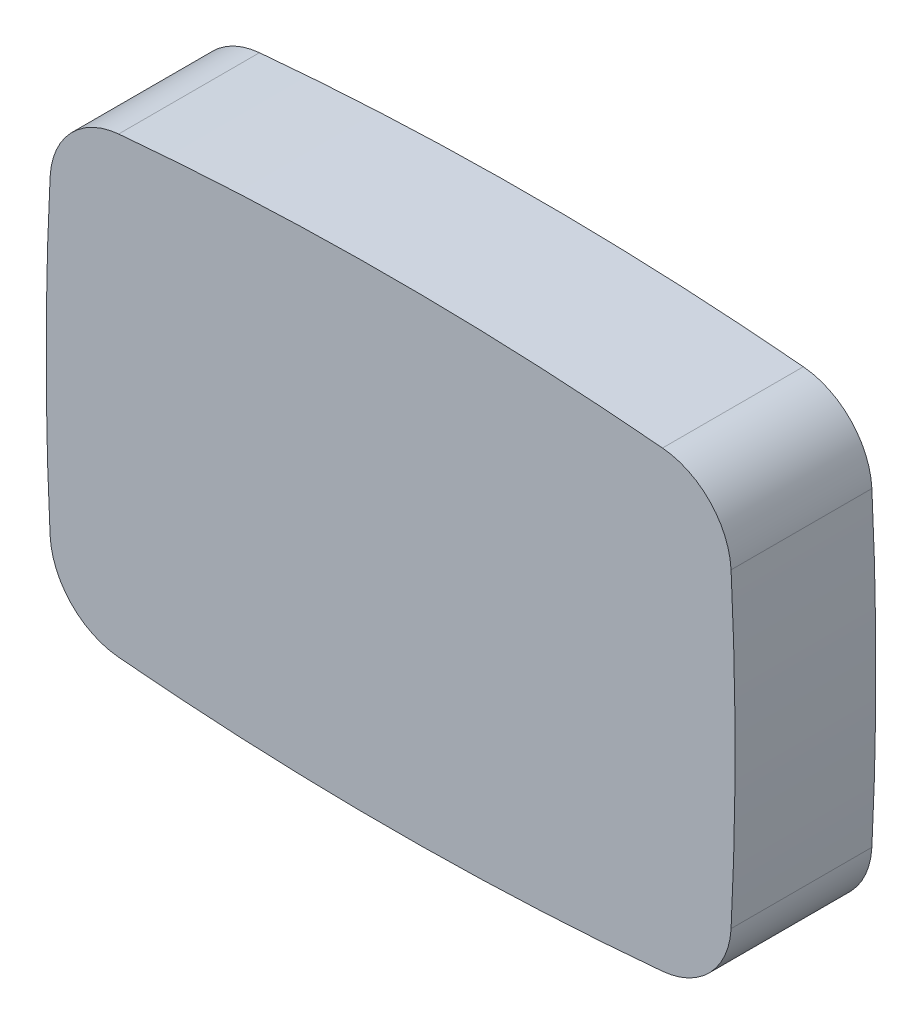
ISO-10303-21;
HEADER;
FILE_DESCRIPTION(('STEP AP214'),'2;1');
FILE_NAME('part.step','',(''),(''),'','','');
FILE_SCHEMA(('AUTOMOTIVE_DESIGN { 1 0 10303 214 1 1 1 1 }'));
ENDSEC;
DATA;
#1=APPLICATION_CONTEXT('core data for automotive mechanical design processes');
#2=APPLICATION_PROTOCOL_DEFINITION('international standard','automotive_design',2000,#1);
#3=PRODUCT_CONTEXT('',#1,'mechanical');
#4=PRODUCT('Part','Part','',(#3));
#5=PRODUCT_RELATED_PRODUCT_CATEGORY('part','',(#4));
#6=PRODUCT_DEFINITION_FORMATION('','',#4);
#7=PRODUCT_DEFINITION_CONTEXT('part definition',#1,'design');
#8=PRODUCT_DEFINITION('design','',#6,#7);
#9=PRODUCT_DEFINITION_SHAPE('','',#8);
#10=(LENGTH_UNIT() NAMED_UNIT(*) SI_UNIT(.MILLI.,.METRE.));
#11=(NAMED_UNIT(*) PLANE_ANGLE_UNIT() SI_UNIT($,.RADIAN.));
#12=(NAMED_UNIT(*) SI_UNIT($,.STERADIAN.) SOLID_ANGLE_UNIT());
#13=UNCERTAINTY_MEASURE_WITH_UNIT(LENGTH_MEASURE(1.E-05),#10,'distance_accuracy_value','');
#14=(GEOMETRIC_REPRESENTATION_CONTEXT(3) GLOBAL_UNCERTAINTY_ASSIGNED_CONTEXT((#13)) GLOBAL_UNIT_ASSIGNED_CONTEXT((#10,
#11,#12)) REPRESENTATION_CONTEXT('',''));
#15=CARTESIAN_POINT('',(0.,0.,0.));
#16=DIRECTION('',(0.,0.,1.));
#17=DIRECTION('',(1.,0.,0.));
#18=AXIS2_PLACEMENT_3D('',#15,#16,#17);
#19=CARTESIAN_POINT('',(52.7241282495517,30.119229257261,28.));
#20=DIRECTION('',(0.,0.,-1.));
#21=DIRECTION('',(-1.,0.,0.));
#22=AXIS2_PLACEMENT_3D('',#19,#20,#21);
#23=CYLINDRICAL_SURFACE('',#22,14.9999999999999);
#24=CARTESIAN_POINT('',(52.7241282495517,30.119229257261,0.));
#25=DIRECTION('',(0.,0.,1.));
#26=DIRECTION('',(-1.,0.,0.));
#27=AXIS2_PLACEMENT_3D('',#24,#25,#26);
#28=CIRCLE('',#27,14.9999999999999);
#29=CARTESIAN_POINT('',(67.7042341021042,30.8915171869343,0.));
#30=VERTEX_POINT('',#29);
#31=CARTESIAN_POINT('',(54.0760289738991,45.0581838536009,0.));
#32=VERTEX_POINT('',#31);
#33=EDGE_CURVE('E129',#30,#32,#28,.T.);
#34=ORIENTED_EDGE('',*,*,#33,.T.);
#35=DIRECTION('',(0.,0.,-1.));
#36=VECTOR('',#35,1.);
#37=CARTESIAN_POINT('',(54.0760289738991,45.0581838536009,28.));
#38=LINE('',#37,#36);
#39=CARTESIAN_POINT('',(54.0760289738991,45.0581838536009,28.));
#40=VERTEX_POINT('',#39);
#41=EDGE_CURVE('E11',#40,#32,#38,.T.);
#42=ORIENTED_EDGE('',*,*,#41,.F.);
#43=CARTESIAN_POINT('',(52.7241282495517,30.119229257261,28.));
#44=DIRECTION('',(0.,0.,1.));
#45=DIRECTION('',(-1.,0.,0.));
#46=AXIS2_PLACEMENT_3D('',#43,#44,#45);
#47=CIRCLE('',#46,14.9999999999999);
#48=CARTESIAN_POINT('',(67.7042341021042,30.8915171869343,28.));
#49=VERTEX_POINT('',#48);
#50=EDGE_CURVE('E143',#49,#40,#47,.T.);
#51=ORIENTED_EDGE('',*,*,#50,.F.);
#52=DIRECTION('',(0.,0.,-1.));
#53=VECTOR('',#52,1.);
#54=CARTESIAN_POINT('',(67.7042341021042,30.8915171869343,28.));
#55=LINE('',#54,#53);
#56=EDGE_CURVE('E125',#49,#30,#55,.T.);
#57=ORIENTED_EDGE('',*,*,#56,.T.);
#58=EDGE_LOOP('',(#34,#42,#51,#57));
#59=FACE_BOUND('',#58,.T.);
#60=ADVANCED_FACE('F33',(#59),#23,.T.);
#61=CARTESIAN_POINT('',(0.,-552.5,28.));
#62=DIRECTION('',(0.,0.,-1.));
#63=DIRECTION('',(-1.,0.,0.));
#64=AXIS2_PLACEMENT_3D('',#61,#62,#63);
#65=CYLINDRICAL_SURFACE('',#64,600.);
#66=CARTESIAN_POINT('',(0.,-552.5,0.));
#67=DIRECTION('',(0.,0.,1.));
#68=DIRECTION('',(1.,0.,0.));
#69=AXIS2_PLACEMENT_3D('',#66,#67,#68);
#70=CIRCLE('',#69,600.);
#71=CARTESIAN_POINT('',(-54.0760289738992,45.0581838536009,0.));
#72=VERTEX_POINT('',#71);
#73=EDGE_CURVE('E132',#32,#72,#70,.T.);
#74=ORIENTED_EDGE('',*,*,#73,.T.);
#75=DIRECTION('',(0.,0.,-1.));
#76=VECTOR('',#75,1.);
#77=CARTESIAN_POINT('',(-54.0760289738992,45.0581838536009,28.));
#78=LINE('',#77,#76);
#79=CARTESIAN_POINT('',(-54.0760289738992,45.0581838536009,28.));
#80=VERTEX_POINT('',#79);
#81=EDGE_CURVE('E41',#80,#72,#78,.T.);
#82=ORIENTED_EDGE('',*,*,#81,.F.);
#83=CARTESIAN_POINT('',(0.,-552.5,28.));
#84=DIRECTION('',(0.,0.,1.));
#85=DIRECTION('',(1.,0.,0.));
#86=AXIS2_PLACEMENT_3D('',#83,#84,#85);
#87=CIRCLE('',#86,600.);
#88=EDGE_CURVE('E92',#40,#80,#87,.T.);
#89=ORIENTED_EDGE('',*,*,#88,.F.);
#90=ORIENTED_EDGE('',*,*,#41,.T.);
#91=EDGE_LOOP('',(#74,#82,#89,#90));
#92=FACE_BOUND('',#91,.T.);
#93=ADVANCED_FACE('F178',(#92),#65,.T.);
#94=CARTESIAN_POINT('',(-52.7241282495517,30.119229257261,28.));
#95=DIRECTION('',(0.,0.,-1.));
#96=DIRECTION('',(-1.,0.,0.));
#97=AXIS2_PLACEMENT_3D('',#94,#95,#96);
#98=CYLINDRICAL_SURFACE('',#97,14.9999999999999);
#99=CARTESIAN_POINT('',(-52.7241282495517,30.119229257261,0.));
#100=DIRECTION('',(0.,0.,1.));
#101=DIRECTION('',(1.,0.,0.));
#102=AXIS2_PLACEMENT_3D('',#99,#100,#101);
#103=CIRCLE('',#102,14.9999999999999);
#104=CARTESIAN_POINT('',(-67.7042341021042,30.8915171869344,0.));
#105=VERTEX_POINT('',#104);
#106=EDGE_CURVE('E134',#72,#105,#103,.T.);
#107=ORIENTED_EDGE('',*,*,#106,.T.);
#108=DIRECTION('',(0.,0.,-1.));
#109=VECTOR('',#108,1.);
#110=CARTESIAN_POINT('',(-67.7042341021042,30.8915171869344,28.));
#111=LINE('',#110,#109);
#112=CARTESIAN_POINT('',(-67.7042341021042,30.8915171869344,28.));
#113=VERTEX_POINT('',#112);
#114=EDGE_CURVE('E150',#113,#105,#111,.T.);
#115=ORIENTED_EDGE('',*,*,#114,.F.);
#116=CARTESIAN_POINT('',(-52.7241282495517,30.119229257261,28.));
#117=DIRECTION('',(0.,0.,1.));
#118=DIRECTION('',(1.,0.,0.));
#119=AXIS2_PLACEMENT_3D('',#116,#117,#118);
#120=CIRCLE('',#119,14.9999999999999);
#121=EDGE_CURVE('E158',#80,#113,#120,.T.);
#122=ORIENTED_EDGE('',*,*,#121,.F.);
#123=ORIENTED_EDGE('',*,*,#81,.T.);
#124=EDGE_LOOP('',(#107,#115,#122,#123));
#125=FACE_BOUND('',#124,.T.);
#126=ADVANCED_FACE('F156',(#125),#98,.T.);
#127=CARTESIAN_POINT('',(531.5,0.,28.));
#128=DIRECTION('',(0.,0.,-1.));
#129=DIRECTION('',(-1.,0.,0.));
#130=AXIS2_PLACEMENT_3D('',#127,#128,#129);
#131=CYLINDRICAL_SURFACE('',#130,600.);
#132=CARTESIAN_POINT('',(531.5,0.,0.));
#133=DIRECTION('',(0.,0.,1.));
#134=DIRECTION('',(1.,0.,0.));
#135=AXIS2_PLACEMENT_3D('',#132,#133,#134);
#136=CIRCLE('',#135,600.);
#137=CARTESIAN_POINT('',(-67.7042341021042,-30.8915171869342,0.));
#138=VERTEX_POINT('',#137);
#139=EDGE_CURVE('E136',#105,#138,#136,.T.);
#140=ORIENTED_EDGE('',*,*,#139,.T.);
#141=DIRECTION('',(0.,0.,-1.));
#142=VECTOR('',#141,1.);
#143=CARTESIAN_POINT('',(-67.7042341021042,-30.8915171869342,28.));
#144=LINE('',#143,#142);
#145=CARTESIAN_POINT('',(-67.7042341021042,-30.8915171869342,28.));
#146=VERTEX_POINT('',#145);
#147=EDGE_CURVE('E147',#146,#138,#144,.T.);
#148=ORIENTED_EDGE('',*,*,#147,.F.);
#149=CARTESIAN_POINT('',(531.5,0.,28.));
#150=DIRECTION('',(0.,0.,1.));
#151=DIRECTION('',(1.,0.,0.));
#152=AXIS2_PLACEMENT_3D('',#149,#150,#151);
#153=CIRCLE('',#152,600.);
#154=EDGE_CURVE('E170',#113,#146,#153,.T.);
#155=ORIENTED_EDGE('',*,*,#154,.F.);
#156=ORIENTED_EDGE('',*,*,#114,.T.);
#157=EDGE_LOOP('',(#140,#148,#155,#156));
#158=FACE_BOUND('',#157,.T.);
#159=ADVANCED_FACE('F166',(#158),#131,.T.);
#160=CARTESIAN_POINT('',(-52.7241282495517,-30.119229257261,28.));
#161=DIRECTION('',(0.,0.,-1.));
#162=DIRECTION('',(-1.,0.,0.));
#163=AXIS2_PLACEMENT_3D('',#160,#161,#162);
#164=CYLINDRICAL_SURFACE('',#163,14.9999999999999);
#165=CARTESIAN_POINT('',(-52.7241282495517,-30.119229257261,0.));
#166=DIRECTION('',(0.,0.,1.));
#167=DIRECTION('',(-1.,0.,0.));
#168=AXIS2_PLACEMENT_3D('',#165,#166,#167);
#169=CIRCLE('',#168,14.9999999999999);
#170=CARTESIAN_POINT('',(-54.0760289738992,-45.0581838536009,0.));
#171=VERTEX_POINT('',#170);
#172=EDGE_CURVE('E138',#138,#171,#169,.T.);
#173=ORIENTED_EDGE('',*,*,#172,.T.);
#174=DIRECTION('',(0.,0.,-1.));
#175=VECTOR('',#174,1.);
#176=CARTESIAN_POINT('',(-54.0760289738992,-45.0581838536009,28.));
#177=LINE('',#176,#175);
#178=CARTESIAN_POINT('',(-54.0760289738992,-45.0581838536009,28.));
#179=VERTEX_POINT('',#178);
#180=EDGE_CURVE('E120',#179,#171,#177,.T.);
#181=ORIENTED_EDGE('',*,*,#180,.F.);
#182=CARTESIAN_POINT('',(-52.7241282495517,-30.119229257261,28.));
#183=DIRECTION('',(0.,0.,1.));
#184=DIRECTION('',(-1.,0.,0.));
#185=AXIS2_PLACEMENT_3D('',#182,#183,#184);
#186=CIRCLE('',#185,14.9999999999999);
#187=EDGE_CURVE('E111',#146,#179,#186,.T.);
#188=ORIENTED_EDGE('',*,*,#187,.F.);
#189=ORIENTED_EDGE('',*,*,#147,.T.);
#190=EDGE_LOOP('',(#173,#181,#188,#189));
#191=FACE_BOUND('',#190,.T.);
#192=ADVANCED_FACE('F169',(#191),#164,.T.);
#193=CARTESIAN_POINT('',(0.,552.5,28.));
#194=DIRECTION('',(0.,0.,-1.));
#195=DIRECTION('',(-1.,0.,0.));
#196=AXIS2_PLACEMENT_3D('',#193,#194,#195);
#197=CYLINDRICAL_SURFACE('',#196,600.);
#198=CARTESIAN_POINT('',(0.,552.5,0.));
#199=DIRECTION('',(0.,0.,1.));
#200=DIRECTION('',(-1.,0.,0.));
#201=AXIS2_PLACEMENT_3D('',#198,#199,#200);
#202=CIRCLE('',#201,600.);
#203=CARTESIAN_POINT('',(54.0760289738996,-45.0581838536009,0.));
#204=VERTEX_POINT('',#203);
#205=EDGE_CURVE('E119',#171,#204,#202,.T.);
#206=ORIENTED_EDGE('',*,*,#205,.T.);
#207=DIRECTION('',(0.,0.,-1.));
#208=VECTOR('',#207,1.);
#209=CARTESIAN_POINT('',(54.0760289738996,-45.0581838536009,28.));
#210=LINE('',#209,#208);
#211=CARTESIAN_POINT('',(54.0760289738996,-45.0581838536009,28.));
#212=VERTEX_POINT('',#211);
#213=EDGE_CURVE('E116',#212,#204,#210,.T.);
#214=ORIENTED_EDGE('',*,*,#213,.F.);
#215=CARTESIAN_POINT('',(0.,552.5,28.));
#216=DIRECTION('',(0.,0.,1.));
#217=DIRECTION('',(-1.,0.,0.));
#218=AXIS2_PLACEMENT_3D('',#215,#216,#217);
#219=CIRCLE('',#218,600.);
#220=EDGE_CURVE('E105',#179,#212,#219,.T.);
#221=ORIENTED_EDGE('',*,*,#220,.F.);
#222=ORIENTED_EDGE('',*,*,#180,.T.);
#223=EDGE_LOOP('',(#206,#214,#221,#222));
#224=FACE_BOUND('',#223,.T.);
#225=ADVANCED_FACE('F117',(#224),#197,.T.);
#226=CARTESIAN_POINT('',(52.7241282495517,-30.119229257261,28.));
#227=DIRECTION('',(0.,0.,-1.));
#228=DIRECTION('',(-1.,0.,0.));
#229=AXIS2_PLACEMENT_3D('',#226,#227,#228);
#230=CYLINDRICAL_SURFACE('',#229,14.9999999999999);
#231=CARTESIAN_POINT('',(52.7241282495517,-30.119229257261,0.));
#232=DIRECTION('',(0.,0.,1.));
#233=DIRECTION('',(1.,0.,0.));
#234=AXIS2_PLACEMENT_3D('',#231,#232,#233);
#235=CIRCLE('',#234,14.9999999999999);
#236=CARTESIAN_POINT('',(67.7042341021042,-30.8915171869344,0.));
#237=VERTEX_POINT('',#236);
#238=EDGE_CURVE('E78',#204,#237,#235,.T.);
#239=ORIENTED_EDGE('',*,*,#238,.T.);
#240=DIRECTION('',(0.,0.,-1.));
#241=VECTOR('',#240,1.);
#242=CARTESIAN_POINT('',(67.7042341021042,-30.8915171869344,28.));
#243=LINE('',#242,#241);
#244=CARTESIAN_POINT('',(67.7042341021042,-30.8915171869344,28.));
#245=VERTEX_POINT('',#244);
#246=EDGE_CURVE('E121',#245,#237,#243,.T.);
#247=ORIENTED_EDGE('',*,*,#246,.F.);
#248=CARTESIAN_POINT('',(52.7241282495517,-30.119229257261,28.));
#249=DIRECTION('',(0.,0.,1.));
#250=DIRECTION('',(1.,0.,0.));
#251=AXIS2_PLACEMENT_3D('',#248,#249,#250);
#252=CIRCLE('',#251,14.9999999999999);
#253=EDGE_CURVE('E109',#212,#245,#252,.T.);
#254=ORIENTED_EDGE('',*,*,#253,.F.);
#255=ORIENTED_EDGE('',*,*,#213,.T.);
#256=EDGE_LOOP('',(#239,#247,#254,#255));
#257=FACE_BOUND('',#256,.T.);
#258=ADVANCED_FACE('F123',(#257),#230,.T.);
#259=CARTESIAN_POINT('',(-531.5,0.,28.));
#260=DIRECTION('',(0.,0.,-1.));
#261=DIRECTION('',(-1.,0.,0.));
#262=AXIS2_PLACEMENT_3D('',#259,#260,#261);
#263=CYLINDRICAL_SURFACE('',#262,600.);
#264=CARTESIAN_POINT('',(-531.5,0.,0.));
#265=DIRECTION('',(0.,0.,1.));
#266=DIRECTION('',(-1.,0.,0.));
#267=AXIS2_PLACEMENT_3D('',#264,#265,#266);
#268=CIRCLE('',#267,600.);
#269=EDGE_CURVE('E84',#237,#30,#268,.T.);
#270=ORIENTED_EDGE('',*,*,#269,.T.);
#271=ORIENTED_EDGE('',*,*,#56,.F.);
#272=CARTESIAN_POINT('',(-531.5,0.,28.));
#273=DIRECTION('',(0.,0.,1.));
#274=DIRECTION('',(-1.,0.,0.));
#275=AXIS2_PLACEMENT_3D('',#272,#273,#274);
#276=CIRCLE('',#275,600.);
#277=EDGE_CURVE('E49',#245,#49,#276,.T.);
#278=ORIENTED_EDGE('',*,*,#277,.F.);
#279=ORIENTED_EDGE('',*,*,#246,.T.);
#280=EDGE_LOOP('',(#270,#271,#278,#279));
#281=FACE_BOUND('',#280,.T.);
#282=ADVANCED_FACE('F194',(#281),#263,.T.);
#283=CARTESIAN_POINT('',(-239.387935875224,15.0596146286305,28.));
#284=DIRECTION('',(0.,0.,-1.));
#285=DIRECTION('',(-1.,0.,0.));
#286=AXIS2_PLACEMENT_3D('',#283,#284,#285);
#287=PLANE('',#286);
#288=ORIENTED_EDGE('',*,*,#50,.T.);
#289=ORIENTED_EDGE('',*,*,#88,.T.);
#290=ORIENTED_EDGE('',*,*,#121,.T.);
#291=ORIENTED_EDGE('',*,*,#154,.T.);
#292=ORIENTED_EDGE('',*,*,#187,.T.);
#293=ORIENTED_EDGE('',*,*,#220,.T.);
#294=ORIENTED_EDGE('',*,*,#253,.T.);
#295=ORIENTED_EDGE('',*,*,#277,.T.);
#296=EDGE_LOOP('',(#288,#289,#290,#291,#292,#293,#294,#295));
#297=FACE_BOUND('',#296,.T.);
#298=ADVANCED_FACE('F107',(#297),#287,.F.);
#299=CARTESIAN_POINT('',(-239.387935875224,15.0596146286305,0.));
#300=DIRECTION('',(0.,0.,-1.));
#301=DIRECTION('',(-1.,0.,0.));
#302=AXIS2_PLACEMENT_3D('',#299,#300,#301);
#303=PLANE('',#302);
#304=ORIENTED_EDGE('',*,*,#33,.F.);
#305=ORIENTED_EDGE('',*,*,#269,.F.);
#306=ORIENTED_EDGE('',*,*,#238,.F.);
#307=ORIENTED_EDGE('',*,*,#205,.F.);
#308=ORIENTED_EDGE('',*,*,#172,.F.);
#309=ORIENTED_EDGE('',*,*,#139,.F.);
#310=ORIENTED_EDGE('',*,*,#106,.F.);
#311=ORIENTED_EDGE('',*,*,#73,.F.);
#312=EDGE_LOOP('',(#304,#305,#306,#307,#308,#309,#310,#311));
#313=FACE_BOUND('',#312,.T.);
#314=ADVANCED_FACE('F162',(#313),#303,.T.);
#315=CLOSED_SHELL('',(#60,#93,#126,#159,#192,#225,#258,#282,#298,#314));
#316=MANIFOLD_SOLID_BREP('B2',#315);
#317=ADVANCED_BREP_SHAPE_REPRESENTATION('',(#18,#316),#14);
#318=SHAPE_DEFINITION_REPRESENTATION(#9,#317);
ENDSEC;
END-ISO-10303-21;
